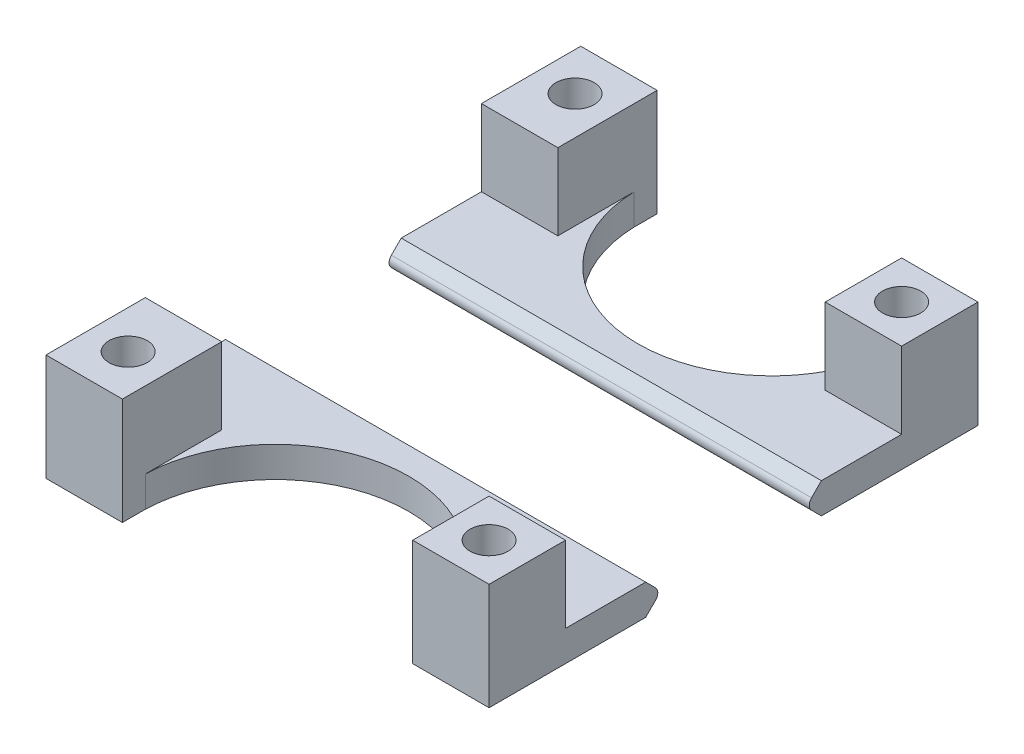
ISO-10303-21;
HEADER;
FILE_DESCRIPTION(('STEP AP214'),'2;1');
FILE_NAME('part.step','',(''),(''),'','','');
FILE_SCHEMA(('AUTOMOTIVE_DESIGN { 1 0 10303 214 1 1 1 1 }'));
ENDSEC;
DATA;
#1=APPLICATION_CONTEXT('core data for automotive mechanical design processes');
#2=APPLICATION_PROTOCOL_DEFINITION('international standard','automotive_design',2000,#1);
#3=PRODUCT_CONTEXT('',#1,'mechanical');
#4=PRODUCT('Part','Part','',(#3));
#5=PRODUCT_RELATED_PRODUCT_CATEGORY('part','',(#4));
#6=PRODUCT_DEFINITION_FORMATION('','',#4);
#7=PRODUCT_DEFINITION_CONTEXT('part definition',#1,'design');
#8=PRODUCT_DEFINITION('design','',#6,#7);
#9=PRODUCT_DEFINITION_SHAPE('','',#8);
#10=(LENGTH_UNIT() NAMED_UNIT(*) SI_UNIT(.MILLI.,.METRE.));
#11=(NAMED_UNIT(*) PLANE_ANGLE_UNIT() SI_UNIT($,.RADIAN.));
#12=(NAMED_UNIT(*) SI_UNIT($,.STERADIAN.) SOLID_ANGLE_UNIT());
#13=UNCERTAINTY_MEASURE_WITH_UNIT(LENGTH_MEASURE(1.E-05),#10,'distance_accuracy_value','');
#14=(GEOMETRIC_REPRESENTATION_CONTEXT(3) GLOBAL_UNCERTAINTY_ASSIGNED_CONTEXT((#13)) GLOBAL_UNIT_ASSIGNED_CONTEXT((#10,
#11,#12)) REPRESENTATION_CONTEXT('',''));
#15=CARTESIAN_POINT('',(0.,0.,0.));
#16=DIRECTION('',(0.,0.,1.));
#17=DIRECTION('',(1.,0.,0.));
#18=AXIS2_PLACEMENT_3D('',#15,#16,#17);
#19=CARTESIAN_POINT('',(0.,4.,0.));
#20=DIRECTION('',(0.,1.,0.));
#21=DIRECTION('',(0.,0.,1.));
#22=AXIS2_PLACEMENT_3D('',#19,#20,#21);
#23=PLANE('',#22);
#24=DIRECTION('',(1.,0.,0.));
#25=VECTOR('',#24,1.);
#26=CARTESIAN_POINT('',(-4.47213595499969,4.,11.5));
#27=LINE('',#26,#25);
#28=CARTESIAN_POINT('',(-1.07051147669731E-13,4.,11.5));
#29=VERTEX_POINT('',#28);
#30=CARTESIAN_POINT('',(55.,4.,11.5));
#31=VERTEX_POINT('',#30);
#32=EDGE_CURVE('E284',#29,#31,#27,.T.);
#33=ORIENTED_EDGE('',*,*,#32,.F.);
#34=DIRECTION('',(0.,0.,1.));
#35=VECTOR('',#34,1.);
#36=CARTESIAN_POINT('',(0.,4.,0.));
#37=LINE('',#36,#35);
#38=CARTESIAN_POINT('',(-1.30891831136949E-13,4.,22.));
#39=VERTEX_POINT('',#38);
#40=EDGE_CURVE('E299',#29,#39,#37,.T.);
#41=ORIENTED_EDGE('',*,*,#40,.T.);
#42=DIRECTION('',(-1.,0.,0.));
#43=VECTOR('',#42,1.);
#44=CARTESIAN_POINT('',(10.,4.,22.));
#45=LINE('',#44,#43);
#46=CARTESIAN_POINT('',(10.,4.,22.));
#47=VERTEX_POINT('',#46);
#48=EDGE_CURVE('E255',#47,#39,#45,.T.);
#49=ORIENTED_EDGE('',*,*,#48,.F.);
#50=DIRECTION('',(0.,0.,-1.));
#51=VECTOR('',#50,1.);
#52=CARTESIAN_POINT('',(10.,4.,35.));
#53=LINE('',#52,#51);
#54=CARTESIAN_POINT('',(10.,4.,32.));
#55=VERTEX_POINT('',#54);
#56=EDGE_CURVE('E189',#55,#47,#53,.T.);
#57=ORIENTED_EDGE('',*,*,#56,.F.);
#58=CARTESIAN_POINT('',(27.5,4.,32.5073529411765));
#59=DIRECTION('',(0.,1.,0.));
#60=DIRECTION('',(0.,0.,1.));
#61=AXIS2_PLACEMENT_3D('',#58,#59,#60);
#62=CIRCLE('',#61,17.5073529411765);
#63=CARTESIAN_POINT('',(45.,4.,32.));
#64=VERTEX_POINT('',#63);
#65=EDGE_CURVE('E207',#64,#55,#62,.T.);
#66=ORIENTED_EDGE('',*,*,#65,.F.);
#67=DIRECTION('',(0.,0.,1.));
#68=VECTOR('',#67,1.);
#69=CARTESIAN_POINT('',(45.,4.,32.));
#70=LINE('',#69,#68);
#71=CARTESIAN_POINT('',(45.,4.,22.));
#72=VERTEX_POINT('',#71);
#73=EDGE_CURVE('E226',#72,#64,#70,.T.);
#74=ORIENTED_EDGE('',*,*,#73,.F.);
#75=DIRECTION('',(-1.,0.,0.));
#76=VECTOR('',#75,1.);
#77=CARTESIAN_POINT('',(45.,4.,22.));
#78=LINE('',#77,#76);
#79=CARTESIAN_POINT('',(55.,4.,22.));
#80=VERTEX_POINT('',#79);
#81=EDGE_CURVE('E221',#80,#72,#78,.T.);
#82=ORIENTED_EDGE('',*,*,#81,.F.);
#83=DIRECTION('',(0.,0.,1.));
#84=VECTOR('',#83,1.);
#85=CARTESIAN_POINT('',(55.,4.,0.));
#86=LINE('',#85,#84);
#87=EDGE_CURVE('E203',#31,#80,#86,.T.);
#88=ORIENTED_EDGE('',*,*,#87,.F.);
#89=EDGE_LOOP('',(#33,#41,#49,#57,#66,#74,#82,#88));
#90=FACE_BOUND('',#89,.T.);
#91=ADVANCED_FACE('F51',(#90),#23,.T.);
#92=CARTESIAN_POINT('',(0.,4.,0.));
#93=DIRECTION('',(1.,0.,0.));
#94=DIRECTION('',(0.,0.,-1.));
#95=AXIS2_PLACEMENT_3D('',#92,#93,#94);
#96=PLANE('',#95);
#97=CARTESIAN_POINT('',(-1.05818132034585E-13,1.99999999999999,10.9142135623731));
#98=DIRECTION('',(1.,0.,0.));
#99=DIRECTION('',(0.,0.,-1.));
#100=AXIS2_PLACEMENT_3D('',#97,#98,#99);
#101=CIRCLE('',#100,1.);
#102=CARTESIAN_POINT('',(-1.04195021618558E-13,1.29289321881344,10.2071067811866));
#103=VERTEX_POINT('',#102);
#104=CARTESIAN_POINT('',(-1.05818132034585E-13,2.70710678118655,10.2071067811866));
#105=VERTEX_POINT('',#104);
#106=EDGE_CURVE('E155',#103,#105,#101,.T.);
#107=ORIENTED_EDGE('',*,*,#106,.F.);
#108=DIRECTION('',(0.,0.707106781186551,-0.707106781186544));
#109=VECTOR('',#108,1.);
#110=CARTESIAN_POINT('',(-1.04083408558608E-13,1.29289321881344,10.2071067811866));
#111=LINE('',#110,#109);
#112=CARTESIAN_POINT('',(-1.07051147669731E-13,0.,11.5));
#113=VERTEX_POINT('',#112);
#114=EDGE_CURVE('E292',#113,#103,#111,.T.);
#115=ORIENTED_EDGE('',*,*,#114,.F.);
#116=DIRECTION('',(0.,0.,1.));
#117=VECTOR('',#116,1.);
#118=CARTESIAN_POINT('',(0.,0.,0.));
#119=LINE('',#118,#117);
#120=CARTESIAN_POINT('',(0.,0.,35.));
#121=VERTEX_POINT('',#120);
#122=EDGE_CURVE('E54',#113,#121,#119,.T.);
#123=ORIENTED_EDGE('',*,*,#122,.T.);
#124=DIRECTION('',(0.,-1.,0.));
#125=VECTOR('',#124,1.);
#126=CARTESIAN_POINT('',(0.,4.,35.));
#127=LINE('',#126,#125);
#128=CARTESIAN_POINT('',(0.,14.,35.));
#129=VERTEX_POINT('',#128);
#130=EDGE_CURVE('E190',#129,#121,#127,.T.);
#131=ORIENTED_EDGE('',*,*,#130,.F.);
#132=DIRECTION('',(0.,0.,1.));
#133=VECTOR('',#132,1.);
#134=CARTESIAN_POINT('',(0.,14.,22.));
#135=LINE('',#134,#133);
#136=CARTESIAN_POINT('',(0.,14.,22.));
#137=VERTEX_POINT('',#136);
#138=EDGE_CURVE('E269',#137,#129,#135,.T.);
#139=ORIENTED_EDGE('',*,*,#138,.F.);
#140=DIRECTION('',(0.,-1.,0.));
#141=VECTOR('',#140,1.);
#142=CARTESIAN_POINT('',(0.,14.,22.));
#143=LINE('',#142,#141);
#144=EDGE_CURVE('E194',#137,#39,#143,.T.);
#145=ORIENTED_EDGE('',*,*,#144,.T.);
#146=ORIENTED_EDGE('',*,*,#40,.F.);
#147=DIRECTION('',(0.,0.707106781186546,0.707106781186549));
#148=VECTOR('',#147,1.);
#149=CARTESIAN_POINT('',(-1.04083408558608E-13,2.70710678118655,10.2071067811866));
#150=LINE('',#149,#148);
#151=EDGE_CURVE('E254',#105,#29,#150,.T.);
#152=ORIENTED_EDGE('',*,*,#151,.F.);
#153=EDGE_LOOP('',(#107,#115,#123,#131,#139,#145,#146,#152));
#154=FACE_BOUND('',#153,.T.);
#155=ADVANCED_FACE('F308',(#154),#96,.F.);
#156=CARTESIAN_POINT('',(0.,4.,35.));
#157=DIRECTION('',(0.,0.,-1.));
#158=DIRECTION('',(-1.,0.,0.));
#159=AXIS2_PLACEMENT_3D('',#156,#157,#158);
#160=PLANE('',#159);
#161=DIRECTION('',(1.,0.,0.));
#162=VECTOR('',#161,1.);
#163=CARTESIAN_POINT('',(0.,0.,35.));
#164=LINE('',#163,#162);
#165=CARTESIAN_POINT('',(10.,0.,35.));
#166=VERTEX_POINT('',#165);
#167=EDGE_CURVE('E191',#121,#166,#164,.T.);
#168=ORIENTED_EDGE('',*,*,#167,.T.);
#169=DIRECTION('',(0.,-1.,0.));
#170=VECTOR('',#169,1.);
#171=CARTESIAN_POINT('',(10.,4.,35.));
#172=LINE('',#171,#170);
#173=CARTESIAN_POINT('',(10.,14.,35.));
#174=VERTEX_POINT('',#173);
#175=EDGE_CURVE('E211',#174,#166,#172,.T.);
#176=ORIENTED_EDGE('',*,*,#175,.F.);
#177=DIRECTION('',(1.,0.,0.));
#178=VECTOR('',#177,1.);
#179=CARTESIAN_POINT('',(10.,14.,35.));
#180=LINE('',#179,#178);
#181=EDGE_CURVE('E262',#129,#174,#180,.T.);
#182=ORIENTED_EDGE('',*,*,#181,.F.);
#183=ORIENTED_EDGE('',*,*,#130,.T.);
#184=EDGE_LOOP('',(#168,#176,#182,#183));
#185=FACE_BOUND('',#184,.T.);
#186=ADVANCED_FACE('F312',(#185),#160,.F.);
#187=CARTESIAN_POINT('',(10.,4.,0.));
#188=DIRECTION('',(-1.,0.,0.));
#189=DIRECTION('',(0.,0.,1.));
#190=AXIS2_PLACEMENT_3D('',#187,#188,#189);
#191=PLANE('',#190);
#192=DIRECTION('',(0.,0.,-1.));
#193=VECTOR('',#192,1.);
#194=CARTESIAN_POINT('',(10.,0.,0.));
#195=LINE('',#194,#193);
#196=CARTESIAN_POINT('',(10.,0.,32.));
#197=VERTEX_POINT('',#196);
#198=EDGE_CURVE('E185',#166,#197,#195,.T.);
#199=ORIENTED_EDGE('',*,*,#198,.T.);
#200=DIRECTION('',(0.,-1.,0.));
#201=VECTOR('',#200,1.);
#202=CARTESIAN_POINT('',(10.,4.,32.));
#203=LINE('',#202,#201);
#204=EDGE_CURVE('E210',#55,#197,#203,.T.);
#205=ORIENTED_EDGE('',*,*,#204,.F.);
#206=ORIENTED_EDGE('',*,*,#56,.T.);
#207=DIRECTION('',(0.,-1.,0.));
#208=VECTOR('',#207,1.);
#209=CARTESIAN_POINT('',(10.,14.,22.));
#210=LINE('',#209,#208);
#211=CARTESIAN_POINT('',(10.,14.,22.));
#212=VERTEX_POINT('',#211);
#213=EDGE_CURVE('E250',#212,#47,#210,.T.);
#214=ORIENTED_EDGE('',*,*,#213,.F.);
#215=DIRECTION('',(0.,0.,-1.));
#216=VECTOR('',#215,1.);
#217=CARTESIAN_POINT('',(10.,14.,35.));
#218=LINE('',#217,#216);
#219=EDGE_CURVE('E220',#174,#212,#218,.T.);
#220=ORIENTED_EDGE('',*,*,#219,.F.);
#221=ORIENTED_EDGE('',*,*,#175,.T.);
#222=EDGE_LOOP('',(#199,#205,#206,#214,#220,#221));
#223=FACE_BOUND('',#222,.T.);
#224=ADVANCED_FACE('F320',(#223),#191,.F.);
#225=CARTESIAN_POINT('',(27.5,4.,32.5073529411765));
#226=DIRECTION('',(0.,-1.,0.));
#227=DIRECTION('',(0.,0.,-1.));
#228=AXIS2_PLACEMENT_3D('',#225,#226,#227);
#229=CYLINDRICAL_SURFACE('',#228,17.5073529411765);
#230=CARTESIAN_POINT('',(27.5,0.,32.5073529411765));
#231=DIRECTION('',(0.,1.,0.));
#232=DIRECTION('',(0.,0.,1.));
#233=AXIS2_PLACEMENT_3D('',#230,#231,#232);
#234=CIRCLE('',#233,17.5073529411765);
#235=CARTESIAN_POINT('',(45.,0.,32.));
#236=VERTEX_POINT('',#235);
#237=EDGE_CURVE('E176',#236,#197,#234,.T.);
#238=ORIENTED_EDGE('',*,*,#237,.F.);
#239=DIRECTION('',(0.,-1.,0.));
#240=VECTOR('',#239,1.);
#241=CARTESIAN_POINT('',(45.,4.,32.));
#242=LINE('',#241,#240);
#243=EDGE_CURVE('E206',#64,#236,#242,.T.);
#244=ORIENTED_EDGE('',*,*,#243,.F.);
#245=ORIENTED_EDGE('',*,*,#65,.T.);
#246=ORIENTED_EDGE('',*,*,#204,.T.);
#247=EDGE_LOOP('',(#238,#244,#245,#246));
#248=FACE_BOUND('',#247,.T.);
#249=ADVANCED_FACE('F334',(#248),#229,.F.);
#250=CARTESIAN_POINT('',(0.,4.,32.));
#251=DIRECTION('',(0.,0.,1.));
#252=DIRECTION('',(1.,0.,0.));
#253=AXIS2_PLACEMENT_3D('',#250,#251,#252);
#254=PLANE('',#253);
#255=DIRECTION('',(-1.,0.,0.));
#256=VECTOR('',#255,1.);
#257=CARTESIAN_POINT('',(0.,0.,32.));
#258=LINE('',#257,#256);
#259=CARTESIAN_POINT('',(55.,0.,32.));
#260=VERTEX_POINT('',#259);
#261=EDGE_CURVE('E173',#260,#236,#258,.T.);
#262=ORIENTED_EDGE('',*,*,#261,.F.);
#263=DIRECTION('',(0.,-1.,0.));
#264=VECTOR('',#263,1.);
#265=CARTESIAN_POINT('',(55.,4.,32.));
#266=LINE('',#265,#264);
#267=CARTESIAN_POINT('',(55.,14.,32.));
#268=VERTEX_POINT('',#267);
#269=EDGE_CURVE('E170',#268,#260,#266,.T.);
#270=ORIENTED_EDGE('',*,*,#269,.F.);
#271=DIRECTION('',(1.,0.,0.));
#272=VECTOR('',#271,1.);
#273=CARTESIAN_POINT('',(55.,14.,32.));
#274=LINE('',#273,#272);
#275=CARTESIAN_POINT('',(45.,14.,32.));
#276=VERTEX_POINT('',#275);
#277=EDGE_CURVE('E239',#276,#268,#274,.T.);
#278=ORIENTED_EDGE('',*,*,#277,.F.);
#279=DIRECTION('',(0.,-1.,0.));
#280=VECTOR('',#279,1.);
#281=CARTESIAN_POINT('',(45.,14.,32.));
#282=LINE('',#281,#280);
#283=EDGE_CURVE('E212',#276,#64,#282,.T.);
#284=ORIENTED_EDGE('',*,*,#283,.T.);
#285=ORIENTED_EDGE('',*,*,#243,.T.);
#286=EDGE_LOOP('',(#262,#270,#278,#284,#285));
#287=FACE_BOUND('',#286,.T.);
#288=ADVANCED_FACE('F330',(#287),#254,.T.);
#289=CARTESIAN_POINT('',(55.,4.,0.));
#290=DIRECTION('',(1.,0.,0.));
#291=DIRECTION('',(0.,0.,-1.));
#292=AXIS2_PLACEMENT_3D('',#289,#290,#291);
#293=PLANE('',#292);
#294=DIRECTION('',(0.,-0.707106781186551,0.707106781186544));
#295=VECTOR('',#294,1.);
#296=CARTESIAN_POINT('',(55.,1.29289321881344,10.2071067811866));
#297=LINE('',#296,#295);
#298=CARTESIAN_POINT('',(55.,1.29289321881344,10.2071067811866));
#299=VERTEX_POINT('',#298);
#300=CARTESIAN_POINT('',(55.,0.,11.5));
#301=VERTEX_POINT('',#300);
#302=EDGE_CURVE('E144',#299,#301,#297,.T.);
#303=ORIENTED_EDGE('',*,*,#302,.F.);
#304=CARTESIAN_POINT('',(55.,1.99999999999999,10.9142135623731));
#305=DIRECTION('',(-1.,0.,0.));
#306=DIRECTION('',(0.,0.,1.));
#307=AXIS2_PLACEMENT_3D('',#304,#305,#306);
#308=CIRCLE('',#307,1.);
#309=CARTESIAN_POINT('',(55.,2.70710678118655,10.2071067811866));
#310=VERTEX_POINT('',#309);
#311=EDGE_CURVE('E12',#310,#299,#308,.T.);
#312=ORIENTED_EDGE('',*,*,#311,.F.);
#313=DIRECTION('',(0.,-0.707106781186546,-0.707106781186549));
#314=VECTOR('',#313,1.);
#315=CARTESIAN_POINT('',(55.,2.70710678118655,10.2071067811866));
#316=LINE('',#315,#314);
#317=EDGE_CURVE('E288',#31,#310,#316,.T.);
#318=ORIENTED_EDGE('',*,*,#317,.F.);
#319=ORIENTED_EDGE('',*,*,#87,.T.);
#320=DIRECTION('',(0.,-1.,0.));
#321=VECTOR('',#320,1.);
#322=CARTESIAN_POINT('',(55.,14.,22.));
#323=LINE('',#322,#321);
#324=CARTESIAN_POINT('',(55.,14.,22.));
#325=VERTEX_POINT('',#324);
#326=EDGE_CURVE('E216',#325,#80,#323,.T.);
#327=ORIENTED_EDGE('',*,*,#326,.F.);
#328=DIRECTION('',(0.,0.,-1.));
#329=VECTOR('',#328,1.);
#330=CARTESIAN_POINT('',(55.,14.,22.));
#331=LINE('',#330,#329);
#332=EDGE_CURVE('E236',#268,#325,#331,.T.);
#333=ORIENTED_EDGE('',*,*,#332,.F.);
#334=ORIENTED_EDGE('',*,*,#269,.T.);
#335=DIRECTION('',(0.,0.,1.));
#336=VECTOR('',#335,1.);
#337=CARTESIAN_POINT('',(55.,0.,0.));
#338=LINE('',#337,#336);
#339=EDGE_CURVE('E162',#301,#260,#338,.T.);
#340=ORIENTED_EDGE('',*,*,#339,.F.);
#341=EDGE_LOOP('',(#303,#312,#318,#319,#327,#333,#334,#340));
#342=FACE_BOUND('',#341,.T.);
#343=ADVANCED_FACE('F168',(#342),#293,.T.);
#344=CARTESIAN_POINT('',(50.,4.,27.));
#345=DIRECTION('',(0.,-1.,0.));
#346=DIRECTION('',(0.,0.,-1.));
#347=AXIS2_PLACEMENT_3D('',#344,#345,#346);
#348=CYLINDRICAL_SURFACE('',#347,2.5);
#349=CARTESIAN_POINT('',(50.,0.,27.));
#350=DIRECTION('',(0.,1.,0.));
#351=DIRECTION('',(0.,0.,1.));
#352=AXIS2_PLACEMENT_3D('',#349,#350,#351);
#353=CIRCLE('',#352,2.5);
#354=CARTESIAN_POINT('',(50.,0.,29.5));
#355=VERTEX_POINT('',#354);
#356=EDGE_CURVE('E195',#355,#355,#353,.T.);
#357=ORIENTED_EDGE('',*,*,#356,.F.);
#358=EDGE_LOOP('',(#357));
#359=FACE_BOUND('',#358,.T.);
#360=CARTESIAN_POINT('',(50.,14.,27.));
#361=DIRECTION('',(0.,1.,0.));
#362=DIRECTION('',(0.,0.,1.));
#363=AXIS2_PLACEMENT_3D('',#360,#361,#362);
#364=CIRCLE('',#363,2.5);
#365=CARTESIAN_POINT('',(50.,14.,29.5));
#366=VERTEX_POINT('',#365);
#367=EDGE_CURVE('E246',#366,#366,#364,.T.);
#368=ORIENTED_EDGE('',*,*,#367,.T.);
#369=EDGE_LOOP('',(#368));
#370=FACE_BOUND('',#369,.T.);
#371=ADVANCED_FACE('F376',(#359,#370),#348,.F.);
#372=CARTESIAN_POINT('',(5.,4.,29.25));
#373=DIRECTION('',(0.,-1.,0.));
#374=DIRECTION('',(0.,0.,-1.));
#375=AXIS2_PLACEMENT_3D('',#372,#373,#374);
#376=CYLINDRICAL_SURFACE('',#375,2.5);
#377=CARTESIAN_POINT('',(5.,0.,29.25));
#378=DIRECTION('',(0.,1.,0.));
#379=DIRECTION('',(0.,0.,1.));
#380=AXIS2_PLACEMENT_3D('',#377,#378,#379);
#381=CIRCLE('',#380,2.5);
#382=CARTESIAN_POINT('',(5.,0.,31.75));
#383=VERTEX_POINT('',#382);
#384=EDGE_CURVE('E184',#383,#383,#381,.T.);
#385=ORIENTED_EDGE('',*,*,#384,.F.);
#386=EDGE_LOOP('',(#385));
#387=FACE_BOUND('',#386,.T.);
#388=CARTESIAN_POINT('',(5.,14.,29.25));
#389=DIRECTION('',(0.,1.,0.));
#390=DIRECTION('',(0.,0.,1.));
#391=AXIS2_PLACEMENT_3D('',#388,#389,#390);
#392=CIRCLE('',#391,2.5);
#393=CARTESIAN_POINT('',(5.,14.,31.75));
#394=VERTEX_POINT('',#393);
#395=EDGE_CURVE('E166',#394,#394,#392,.T.);
#396=ORIENTED_EDGE('',*,*,#395,.T.);
#397=EDGE_LOOP('',(#396));
#398=FACE_BOUND('',#397,.T.);
#399=ADVANCED_FACE('F368',(#387,#398),#376,.F.);
#400=CARTESIAN_POINT('',(0.,0.,0.));
#401=DIRECTION('',(0.,1.,0.));
#402=DIRECTION('',(0.,0.,1.));
#403=AXIS2_PLACEMENT_3D('',#400,#401,#402);
#404=PLANE('',#403);
#405=ORIENTED_EDGE('',*,*,#122,.F.);
#406=DIRECTION('',(1.,0.,0.));
#407=VECTOR('',#406,1.);
#408=CARTESIAN_POINT('',(-4.47213595499969,0.,11.5));
#409=LINE('',#408,#407);
#410=EDGE_CURVE('E147',#113,#301,#409,.T.);
#411=ORIENTED_EDGE('',*,*,#410,.T.);
#412=ORIENTED_EDGE('',*,*,#339,.T.);
#413=ORIENTED_EDGE('',*,*,#261,.T.);
#414=ORIENTED_EDGE('',*,*,#237,.T.);
#415=ORIENTED_EDGE('',*,*,#198,.F.);
#416=ORIENTED_EDGE('',*,*,#167,.F.);
#417=EDGE_LOOP('',(#405,#411,#412,#413,#414,#415,#416));
#418=FACE_BOUND('',#417,.T.);
#419=ORIENTED_EDGE('',*,*,#384,.T.);
#420=EDGE_LOOP('',(#419));
#421=FACE_BOUND('',#420,.T.);
#422=ORIENTED_EDGE('',*,*,#356,.T.);
#423=EDGE_LOOP('',(#422));
#424=FACE_BOUND('',#423,.T.);
#425=ADVANCED_FACE('F159',(#418,#421,#424),#404,.F.);
#426=CARTESIAN_POINT('',(0.,14.,0.));
#427=DIRECTION('',(0.,-1.,0.));
#428=DIRECTION('',(0.,0.,-1.));
#429=AXIS2_PLACEMENT_3D('',#426,#427,#428);
#430=PLANE('',#429);
#431=DIRECTION('',(0.,0.,1.));
#432=VECTOR('',#431,1.);
#433=CARTESIAN_POINT('',(45.,14.,32.));
#434=LINE('',#433,#432);
#435=CARTESIAN_POINT('',(45.,14.,22.));
#436=VERTEX_POINT('',#435);
#437=EDGE_CURVE('E199',#436,#276,#434,.T.);
#438=ORIENTED_EDGE('',*,*,#437,.T.);
#439=ORIENTED_EDGE('',*,*,#277,.T.);
#440=ORIENTED_EDGE('',*,*,#332,.T.);
#441=DIRECTION('',(-1.,0.,0.));
#442=VECTOR('',#441,1.);
#443=CARTESIAN_POINT('',(45.,14.,22.));
#444=LINE('',#443,#442);
#445=EDGE_CURVE('E233',#325,#436,#444,.T.);
#446=ORIENTED_EDGE('',*,*,#445,.T.);
#447=EDGE_LOOP('',(#438,#439,#440,#446));
#448=FACE_BOUND('',#447,.T.);
#449=ORIENTED_EDGE('',*,*,#367,.F.);
#450=EDGE_LOOP('',(#449));
#451=FACE_BOUND('',#450,.T.);
#452=ADVANCED_FACE('F367',(#448,#451),#430,.F.);
#453=CARTESIAN_POINT('',(45.,14.,32.));
#454=DIRECTION('',(1.,0.,0.));
#455=DIRECTION('',(0.,0.,-1.));
#456=AXIS2_PLACEMENT_3D('',#453,#454,#455);
#457=PLANE('',#456);
#458=ORIENTED_EDGE('',*,*,#73,.T.);
#459=ORIENTED_EDGE('',*,*,#283,.F.);
#460=ORIENTED_EDGE('',*,*,#437,.F.);
#461=DIRECTION('',(0.,-1.,0.));
#462=VECTOR('',#461,1.);
#463=CARTESIAN_POINT('',(45.,14.,22.));
#464=LINE('',#463,#462);
#465=EDGE_CURVE('E222',#436,#72,#464,.T.);
#466=ORIENTED_EDGE('',*,*,#465,.T.);
#467=EDGE_LOOP('',(#458,#459,#460,#466));
#468=FACE_BOUND('',#467,.T.);
#469=ADVANCED_FACE('F373',(#468),#457,.F.);
#470=CARTESIAN_POINT('',(45.,14.,22.));
#471=DIRECTION('',(0.,0.,1.));
#472=DIRECTION('',(1.,0.,0.));
#473=AXIS2_PLACEMENT_3D('',#470,#471,#472);
#474=PLANE('',#473);
#475=ORIENTED_EDGE('',*,*,#81,.T.);
#476=ORIENTED_EDGE('',*,*,#465,.F.);
#477=ORIENTED_EDGE('',*,*,#445,.F.);
#478=ORIENTED_EDGE('',*,*,#326,.T.);
#479=EDGE_LOOP('',(#475,#476,#477,#478));
#480=FACE_BOUND('',#479,.T.);
#481=ADVANCED_FACE('F397',(#480),#474,.F.);
#482=CARTESIAN_POINT('',(0.,14.,0.));
#483=DIRECTION('',(0.,1.,0.));
#484=DIRECTION('',(0.,0.,1.));
#485=AXIS2_PLACEMENT_3D('',#482,#483,#484);
#486=PLANE('',#485);
#487=ORIENTED_EDGE('',*,*,#219,.T.);
#488=DIRECTION('',(-1.,0.,0.));
#489=VECTOR('',#488,1.);
#490=CARTESIAN_POINT('',(10.,14.,22.));
#491=LINE('',#490,#489);
#492=EDGE_CURVE('E273',#212,#137,#491,.T.);
#493=ORIENTED_EDGE('',*,*,#492,.T.);
#494=ORIENTED_EDGE('',*,*,#138,.T.);
#495=ORIENTED_EDGE('',*,*,#181,.T.);
#496=EDGE_LOOP('',(#487,#493,#494,#495));
#497=FACE_BOUND('',#496,.T.);
#498=ORIENTED_EDGE('',*,*,#395,.F.);
#499=EDGE_LOOP('',(#498));
#500=FACE_BOUND('',#499,.T.);
#501=ADVANCED_FACE('F340',(#497,#500),#486,.T.);
#502=CARTESIAN_POINT('',(10.,14.,22.));
#503=DIRECTION('',(0.,0.,1.));
#504=DIRECTION('',(1.,0.,0.));
#505=AXIS2_PLACEMENT_3D('',#502,#503,#504);
#506=PLANE('',#505);
#507=ORIENTED_EDGE('',*,*,#48,.T.);
#508=ORIENTED_EDGE('',*,*,#144,.F.);
#509=ORIENTED_EDGE('',*,*,#492,.F.);
#510=ORIENTED_EDGE('',*,*,#213,.T.);
#511=EDGE_LOOP('',(#507,#508,#509,#510));
#512=FACE_BOUND('',#511,.T.);
#513=ADVANCED_FACE('F337',(#512),#506,.F.);
#514=CARTESIAN_POINT('',(-4.47213595499969,2.70710678118655,10.2071067811866));
#515=DIRECTION('',(0.,-0.707106781186549,0.707106781186546));
#516=DIRECTION('',(0.,-0.707106781186546,-0.707106781186549));
#517=AXIS2_PLACEMENT_3D('',#514,#515,#516);
#518=PLANE('',#517);
#519=ORIENTED_EDGE('',*,*,#151,.T.);
#520=ORIENTED_EDGE('',*,*,#32,.T.);
#521=ORIENTED_EDGE('',*,*,#317,.T.);
#522=DIRECTION('',(1.,0.,0.));
#523=VECTOR('',#522,1.);
#524=CARTESIAN_POINT('',(-4.47213595499969,2.70710678118655,10.2071067811866));
#525=LINE('',#524,#523);
#526=EDGE_CURVE('E61',#105,#310,#525,.T.);
#527=ORIENTED_EDGE('',*,*,#526,.F.);
#528=EDGE_LOOP('',(#519,#520,#521,#527));
#529=FACE_BOUND('',#528,.T.);
#530=ADVANCED_FACE('F344',(#529),#518,.F.);
#531=CARTESIAN_POINT('',(-4.47213595499969,1.29289321881344,10.2071067811866));
#532=DIRECTION('',(0.,0.707106781186544,0.707106781186551));
#533=DIRECTION('',(0.,-0.707106781186551,0.707106781186544));
#534=AXIS2_PLACEMENT_3D('',#531,#532,#533);
#535=PLANE('',#534);
#536=ORIENTED_EDGE('',*,*,#114,.T.);
#537=DIRECTION('',(1.,0.,0.));
#538=VECTOR('',#537,1.);
#539=CARTESIAN_POINT('',(-4.47213595499969,1.29289321881344,10.2071067811866));
#540=LINE('',#539,#538);
#541=EDGE_CURVE('E150',#103,#299,#540,.T.);
#542=ORIENTED_EDGE('',*,*,#541,.T.);
#543=ORIENTED_EDGE('',*,*,#302,.T.);
#544=ORIENTED_EDGE('',*,*,#410,.F.);
#545=EDGE_LOOP('',(#536,#542,#543,#544));
#546=FACE_BOUND('',#545,.T.);
#547=ADVANCED_FACE('F146',(#546),#535,.F.);
#548=CARTESIAN_POINT('',(-4.47213595499969,1.99999999999999,10.9142135623731));
#549=DIRECTION('',(1.,0.,0.));
#550=DIRECTION('',(0.,0.,-1.));
#551=AXIS2_PLACEMENT_3D('',#548,#549,#550);
#552=CYLINDRICAL_SURFACE('',#551,1.);
#553=ORIENTED_EDGE('',*,*,#106,.T.);
#554=ORIENTED_EDGE('',*,*,#526,.T.);
#555=ORIENTED_EDGE('',*,*,#311,.T.);
#556=ORIENTED_EDGE('',*,*,#541,.F.);
#557=EDGE_LOOP('',(#553,#554,#555,#556));
#558=FACE_BOUND('',#557,.T.);
#559=ADVANCED_FACE('F349',(#558),#552,.T.);
#560=CLOSED_SHELL('',(#91,#155,#186,#224,#249,#288,#343,#371,#399,#425,#452,#469,#481,#501,#513,
#530,#547,#559));
#561=MANIFOLD_SOLID_BREP('B2',#560);
#562=CARTESIAN_POINT('',(45.,14.,-32.));
#563=DIRECTION('',(1.,0.,0.));
#564=DIRECTION('',(0.,0.,-1.));
#565=AXIS2_PLACEMENT_3D('',#562,#563,#564);
#566=PLANE('',#565);
#567=DIRECTION('',(0.,0.,1.));
#568=VECTOR('',#567,1.);
#569=CARTESIAN_POINT('',(45.,4.,-32.));
#570=LINE('',#569,#568);
#571=CARTESIAN_POINT('',(45.,4.,-32.));
#572=VERTEX_POINT('',#571);
#573=CARTESIAN_POINT('',(45.,4.,-22.));
#574=VERTEX_POINT('',#573);
#575=EDGE_CURVE('E792',#572,#574,#570,.T.);
#576=ORIENTED_EDGE('',*,*,#575,.T.);
#577=DIRECTION('',(0.,-1.,0.));
#578=VECTOR('',#577,1.);
#579=CARTESIAN_POINT('',(45.,14.,-22.));
#580=LINE('',#579,#578);
#581=CARTESIAN_POINT('',(45.,14.,-22.));
#582=VERTEX_POINT('',#581);
#583=EDGE_CURVE('E788',#582,#574,#580,.T.);
#584=ORIENTED_EDGE('',*,*,#583,.F.);
#585=DIRECTION('',(0.,0.,1.));
#586=VECTOR('',#585,1.);
#587=CARTESIAN_POINT('',(45.,14.,-32.));
#588=LINE('',#587,#586);
#589=CARTESIAN_POINT('',(45.,14.,-32.));
#590=VERTEX_POINT('',#589);
#591=EDGE_CURVE('E791',#590,#582,#588,.T.);
#592=ORIENTED_EDGE('',*,*,#591,.F.);
#593=DIRECTION('',(0.,-1.,0.));
#594=VECTOR('',#593,1.);
#595=CARTESIAN_POINT('',(45.,14.,-32.));
#596=LINE('',#595,#594);
#597=EDGE_CURVE('E785',#590,#572,#596,.T.);
#598=ORIENTED_EDGE('',*,*,#597,.T.);
#599=EDGE_LOOP('',(#576,#584,#592,#598));
#600=FACE_BOUND('',#599,.T.);
#601=ADVANCED_FACE('F594',(#600),#566,.F.);
#602=CARTESIAN_POINT('',(0.,14.,0.));
#603=DIRECTION('',(0.,1.,0.));
#604=DIRECTION('',(0.,0.,1.));
#605=AXIS2_PLACEMENT_3D('',#602,#603,#604);
#606=PLANE('',#605);
#607=DIRECTION('',(1.,0.,0.));
#608=VECTOR('',#607,1.);
#609=CARTESIAN_POINT('',(0.,14.,-22.));
#610=LINE('',#609,#608);
#611=CARTESIAN_POINT('',(0.,14.,-22.));
#612=VERTEX_POINT('',#611);
#613=CARTESIAN_POINT('',(10.,14.,-22.));
#614=VERTEX_POINT('',#613);
#615=EDGE_CURVE('E766',#612,#614,#610,.T.);
#616=ORIENTED_EDGE('',*,*,#615,.T.);
#617=DIRECTION('',(0.,0.,-1.));
#618=VECTOR('',#617,1.);
#619=CARTESIAN_POINT('',(10.,14.,-22.));
#620=LINE('',#619,#618);
#621=CARTESIAN_POINT('',(10.,14.,-35.));
#622=VERTEX_POINT('',#621);
#623=EDGE_CURVE('E775',#614,#622,#620,.T.);
#624=ORIENTED_EDGE('',*,*,#623,.T.);
#625=DIRECTION('',(-1.,0.,0.));
#626=VECTOR('',#625,1.);
#627=CARTESIAN_POINT('',(10.,14.,-35.));
#628=LINE('',#627,#626);
#629=CARTESIAN_POINT('',(0.,14.,-35.));
#630=VERTEX_POINT('',#629);
#631=EDGE_CURVE('E772',#622,#630,#628,.T.);
#632=ORIENTED_EDGE('',*,*,#631,.T.);
#633=DIRECTION('',(0.,0.,1.));
#634=VECTOR('',#633,1.);
#635=CARTESIAN_POINT('',(0.,14.,-35.));
#636=LINE('',#635,#634);
#637=EDGE_CURVE('E764',#630,#612,#636,.T.);
#638=ORIENTED_EDGE('',*,*,#637,.T.);
#639=EDGE_LOOP('',(#616,#624,#632,#638));
#640=FACE_BOUND('',#639,.T.);
#641=CARTESIAN_POINT('',(5.,14.,-29.25));
#642=DIRECTION('',(0.,1.,0.));
#643=DIRECTION('',(0.,0.,1.));
#644=AXIS2_PLACEMENT_3D('',#641,#642,#643);
#645=CIRCLE('',#644,2.5);
#646=CARTESIAN_POINT('',(5.,14.,-26.75));
#647=VERTEX_POINT('',#646);
#648=EDGE_CURVE('E770',#647,#647,#645,.T.);
#649=ORIENTED_EDGE('',*,*,#648,.F.);
#650=EDGE_LOOP('',(#649));
#651=FACE_BOUND('',#650,.T.);
#652=ADVANCED_FACE('F832',(#640,#651),#606,.T.);
#653=CARTESIAN_POINT('',(0.,14.,-22.));
#654=DIRECTION('',(0.,0.,-1.));
#655=DIRECTION('',(-1.,0.,0.));
#656=AXIS2_PLACEMENT_3D('',#653,#654,#655);
#657=PLANE('',#656);
#658=DIRECTION('',(1.,0.,0.));
#659=VECTOR('',#658,1.);
#660=CARTESIAN_POINT('',(0.,4.,-22.));
#661=LINE('',#660,#659);
#662=CARTESIAN_POINT('',(0.,4.,-22.));
#663=VERTEX_POINT('',#662);
#664=CARTESIAN_POINT('',(10.,4.,-22.));
#665=VERTEX_POINT('',#664);
#666=EDGE_CURVE('E767',#663,#665,#661,.T.);
#667=ORIENTED_EDGE('',*,*,#666,.T.);
#668=DIRECTION('',(0.,-1.,0.));
#669=VECTOR('',#668,1.);
#670=CARTESIAN_POINT('',(10.,14.,-22.));
#671=LINE('',#670,#669);
#672=EDGE_CURVE('E756',#614,#665,#671,.T.);
#673=ORIENTED_EDGE('',*,*,#672,.F.);
#674=ORIENTED_EDGE('',*,*,#615,.F.);
#675=DIRECTION('',(0.,-1.,0.));
#676=VECTOR('',#675,1.);
#677=CARTESIAN_POINT('',(0.,14.,-22.));
#678=LINE('',#677,#676);
#679=EDGE_CURVE('E761',#612,#663,#678,.T.);
#680=ORIENTED_EDGE('',*,*,#679,.T.);
#681=EDGE_LOOP('',(#667,#673,#674,#680));
#682=FACE_BOUND('',#681,.T.);
#683=ADVANCED_FACE('F838',(#682),#657,.F.);
#684=CARTESIAN_POINT('',(45.,14.,-22.));
#685=DIRECTION('',(0.,0.,-1.));
#686=DIRECTION('',(-1.,0.,0.));
#687=AXIS2_PLACEMENT_3D('',#684,#685,#686);
#688=PLANE('',#687);
#689=DIRECTION('',(1.,0.,0.));
#690=VECTOR('',#689,1.);
#691=CARTESIAN_POINT('',(45.,4.,-22.));
#692=LINE('',#691,#690);
#693=CARTESIAN_POINT('',(55.,4.,-22.));
#694=VERTEX_POINT('',#693);
#695=EDGE_CURVE('E617',#574,#694,#692,.T.);
#696=ORIENTED_EDGE('',*,*,#695,.T.);
#697=DIRECTION('',(0.,-1.,0.));
#698=VECTOR('',#697,1.);
#699=CARTESIAN_POINT('',(55.,14.,-22.));
#700=LINE('',#699,#698);
#701=CARTESIAN_POINT('',(55.,14.,-22.));
#702=VERTEX_POINT('',#701);
#703=EDGE_CURVE('E782',#702,#694,#700,.T.);
#704=ORIENTED_EDGE('',*,*,#703,.F.);
#705=DIRECTION('',(1.,0.,0.));
#706=VECTOR('',#705,1.);
#707=CARTESIAN_POINT('',(45.,14.,-22.));
#708=LINE('',#707,#706);
#709=EDGE_CURVE('E794',#582,#702,#708,.T.);
#710=ORIENTED_EDGE('',*,*,#709,.F.);
#711=ORIENTED_EDGE('',*,*,#583,.T.);
#712=EDGE_LOOP('',(#696,#704,#710,#711));
#713=FACE_BOUND('',#712,.T.);
#714=ADVANCED_FACE('F855',(#713),#688,.F.);
#715=CARTESIAN_POINT('',(0.,14.,0.));
#716=DIRECTION('',(0.,1.,0.));
#717=DIRECTION('',(0.,0.,1.));
#718=AXIS2_PLACEMENT_3D('',#715,#716,#717);
#719=PLANE('',#718);
#720=ORIENTED_EDGE('',*,*,#709,.T.);
#721=DIRECTION('',(0.,0.,-1.));
#722=VECTOR('',#721,1.);
#723=CARTESIAN_POINT('',(55.,14.,-22.));
#724=LINE('',#723,#722);
#725=CARTESIAN_POINT('',(55.,14.,-32.));
#726=VERTEX_POINT('',#725);
#727=EDGE_CURVE('E800',#702,#726,#724,.T.);
#728=ORIENTED_EDGE('',*,*,#727,.T.);
#729=DIRECTION('',(-1.,0.,0.));
#730=VECTOR('',#729,1.);
#731=CARTESIAN_POINT('',(55.,14.,-32.));
#732=LINE('',#731,#730);
#733=EDGE_CURVE('E798',#726,#590,#732,.T.);
#734=ORIENTED_EDGE('',*,*,#733,.T.);
#735=ORIENTED_EDGE('',*,*,#591,.T.);
#736=EDGE_LOOP('',(#720,#728,#734,#735));
#737=FACE_BOUND('',#736,.T.);
#738=CARTESIAN_POINT('',(50.,14.,-27.));
#739=DIRECTION('',(0.,1.,0.));
#740=DIRECTION('',(0.,0.,1.));
#741=AXIS2_PLACEMENT_3D('',#738,#739,#740);
#742=CIRCLE('',#741,2.5);
#743=CARTESIAN_POINT('',(50.,14.,-24.5));
#744=VERTEX_POINT('',#743);
#745=EDGE_CURVE('E796',#744,#744,#742,.T.);
#746=ORIENTED_EDGE('',*,*,#745,.F.);
#747=EDGE_LOOP('',(#746));
#748=FACE_BOUND('',#747,.T.);
#749=ADVANCED_FACE('F851',(#737,#748),#719,.T.);
#750=CARTESIAN_POINT('',(0.,4.,-32.));
#751=DIRECTION('',(0.,0.,1.));
#752=DIRECTION('',(1.,0.,0.));
#753=AXIS2_PLACEMENT_3D('',#750,#751,#752);
#754=PLANE('',#753);
#755=DIRECTION('',(-1.,0.,0.));
#756=VECTOR('',#755,1.);
#757=CARTESIAN_POINT('',(0.,0.,-32.));
#758=LINE('',#757,#756);
#759=CARTESIAN_POINT('',(55.,0.,-32.));
#760=VERTEX_POINT('',#759);
#761=CARTESIAN_POINT('',(45.,0.,-32.));
#762=VERTEX_POINT('',#761);
#763=EDGE_CURVE('E715',#760,#762,#758,.T.);
#764=ORIENTED_EDGE('',*,*,#763,.T.);
#765=DIRECTION('',(0.,-1.,0.));
#766=VECTOR('',#765,1.);
#767=CARTESIAN_POINT('',(45.,4.,-32.));
#768=LINE('',#767,#766);
#769=EDGE_CURVE('E49',#572,#762,#768,.T.);
#770=ORIENTED_EDGE('',*,*,#769,.F.);
#771=ORIENTED_EDGE('',*,*,#597,.F.);
#772=ORIENTED_EDGE('',*,*,#733,.F.);
#773=DIRECTION('',(0.,-1.,0.));
#774=VECTOR('',#773,1.);
#775=CARTESIAN_POINT('',(55.,4.,-32.));
#776=LINE('',#775,#774);
#777=EDGE_CURVE('E725',#726,#760,#776,.T.);
#778=ORIENTED_EDGE('',*,*,#777,.T.);
#779=EDGE_LOOP('',(#764,#770,#771,#772,#778));
#780=FACE_BOUND('',#779,.T.);
#781=ADVANCED_FACE('F844',(#780),#754,.F.);
#782=CARTESIAN_POINT('',(27.5,4.,-32.5073529411765));
#783=DIRECTION('',(0.,-1.,0.));
#784=DIRECTION('',(0.,0.,-1.));
#785=AXIS2_PLACEMENT_3D('',#782,#783,#784);
#786=CYLINDRICAL_SURFACE('',#785,17.5073529411765);
#787=CARTESIAN_POINT('',(27.5,0.,-32.5073529411765));
#788=DIRECTION('',(0.,1.,0.));
#789=DIRECTION('',(0.,0.,1.));
#790=AXIS2_PLACEMENT_3D('',#787,#788,#789);
#791=CIRCLE('',#790,17.5073529411765);
#792=CARTESIAN_POINT('',(10.,0.,-32.));
#793=VERTEX_POINT('',#792);
#794=EDGE_CURVE('E745',#762,#793,#791,.F.);
#795=ORIENTED_EDGE('',*,*,#794,.T.);
#796=DIRECTION('',(0.,-1.,0.));
#797=VECTOR('',#796,1.);
#798=CARTESIAN_POINT('',(10.,4.,-32.));
#799=LINE('',#798,#797);
#800=CARTESIAN_POINT('',(10.,4.,-32.));
#801=VERTEX_POINT('',#800);
#802=EDGE_CURVE('E602',#801,#793,#799,.T.);
#803=ORIENTED_EDGE('',*,*,#802,.F.);
#804=CARTESIAN_POINT('',(27.5,4.,-32.5073529411765));
#805=DIRECTION('',(0.,1.,0.));
#806=DIRECTION('',(0.,0.,1.));
#807=AXIS2_PLACEMENT_3D('',#804,#805,#806);
#808=CIRCLE('',#807,17.5073529411765);
#809=EDGE_CURVE('E716',#572,#801,#808,.F.);
#810=ORIENTED_EDGE('',*,*,#809,.F.);
#811=ORIENTED_EDGE('',*,*,#769,.T.);
#812=EDGE_LOOP('',(#795,#803,#810,#811));
#813=FACE_BOUND('',#812,.T.);
#814=ADVANCED_FACE('F841',(#813),#786,.F.);
#815=CARTESIAN_POINT('',(9.99999999999997,4.,0.));
#816=DIRECTION('',(-1.,0.,0.));
#817=DIRECTION('',(0.,0.,1.));
#818=AXIS2_PLACEMENT_3D('',#815,#816,#817);
#819=PLANE('',#818);
#820=DIRECTION('',(0.,0.,-1.));
#821=VECTOR('',#820,1.);
#822=CARTESIAN_POINT('',(9.99999999999997,0.,0.));
#823=LINE('',#822,#821);
#824=CARTESIAN_POINT('',(10.,0.,-35.));
#825=VERTEX_POINT('',#824);
#826=EDGE_CURVE('E739',#793,#825,#823,.T.);
#827=ORIENTED_EDGE('',*,*,#826,.T.);
#828=DIRECTION('',(0.,-1.,0.));
#829=VECTOR('',#828,1.);
#830=CARTESIAN_POINT('',(10.,4.,-35.));
#831=LINE('',#830,#829);
#832=EDGE_CURVE('E731',#622,#825,#831,.T.);
#833=ORIENTED_EDGE('',*,*,#832,.F.);
#834=ORIENTED_EDGE('',*,*,#623,.F.);
#835=ORIENTED_EDGE('',*,*,#672,.T.);
#836=DIRECTION('',(0.,0.,-1.));
#837=VECTOR('',#836,1.);
#838=CARTESIAN_POINT('',(10.,4.,-22.));
#839=LINE('',#838,#837);
#840=EDGE_CURVE('E741',#665,#801,#839,.T.);
#841=ORIENTED_EDGE('',*,*,#840,.T.);
#842=ORIENTED_EDGE('',*,*,#802,.T.);
#843=EDGE_LOOP('',(#827,#833,#834,#835,#841,#842));
#844=FACE_BOUND('',#843,.T.);
#845=ADVANCED_FACE('F738',(#844),#819,.F.);
#846=CARTESIAN_POINT('',(0.,4.,-35.));
#847=DIRECTION('',(0.,0.,1.));
#848=DIRECTION('',(1.,0.,0.));
#849=AXIS2_PLACEMENT_3D('',#846,#847,#848);
#850=PLANE('',#849);
#851=DIRECTION('',(-1.,0.,0.));
#852=VECTOR('',#851,1.);
#853=CARTESIAN_POINT('',(0.,0.,-35.));
#854=LINE('',#853,#852);
#855=CARTESIAN_POINT('',(0.,0.,-35.));
#856=VERTEX_POINT('',#855);
#857=EDGE_CURVE('E721',#825,#856,#854,.T.);
#858=ORIENTED_EDGE('',*,*,#857,.T.);
#859=DIRECTION('',(0.,-1.,0.));
#860=VECTOR('',#859,1.);
#861=CARTESIAN_POINT('',(0.,4.,-35.));
#862=LINE('',#861,#860);
#863=EDGE_CURVE('E727',#630,#856,#862,.T.);
#864=ORIENTED_EDGE('',*,*,#863,.F.);
#865=ORIENTED_EDGE('',*,*,#631,.F.);
#866=ORIENTED_EDGE('',*,*,#832,.T.);
#867=EDGE_LOOP('',(#858,#864,#865,#866));
#868=FACE_BOUND('',#867,.T.);
#869=ADVANCED_FACE('F830',(#868),#850,.F.);
#870=CARTESIAN_POINT('',(5.,4.,-29.25));
#871=DIRECTION('',(0.,-1.,0.));
#872=DIRECTION('',(0.,0.,-1.));
#873=AXIS2_PLACEMENT_3D('',#870,#871,#872);
#874=CYLINDRICAL_SURFACE('',#873,2.5);
#875=CARTESIAN_POINT('',(5.,0.,-29.25));
#876=DIRECTION('',(0.,1.,0.));
#877=DIRECTION('',(0.,0.,1.));
#878=AXIS2_PLACEMENT_3D('',#875,#876,#877);
#879=CIRCLE('',#878,2.5);
#880=CARTESIAN_POINT('',(5.,0.,-26.75));
#881=VERTEX_POINT('',#880);
#882=EDGE_CURVE('E753',#881,#881,#879,.T.);
#883=ORIENTED_EDGE('',*,*,#882,.F.);
#884=EDGE_LOOP('',(#883));
#885=FACE_BOUND('',#884,.T.);
#886=ORIENTED_EDGE('',*,*,#648,.T.);
#887=EDGE_LOOP('',(#886));
#888=FACE_BOUND('',#887,.T.);
#889=ADVANCED_FACE('F596',(#885,#888),#874,.F.);
#890=CARTESIAN_POINT('',(50.,4.,-27.));
#891=DIRECTION('',(0.,-1.,0.));
#892=DIRECTION('',(0.,0.,-1.));
#893=AXIS2_PLACEMENT_3D('',#890,#891,#892);
#894=CYLINDRICAL_SURFACE('',#893,2.5);
#895=CARTESIAN_POINT('',(50.,0.,-27.));
#896=DIRECTION('',(0.,1.,0.));
#897=DIRECTION('',(0.,0.,1.));
#898=AXIS2_PLACEMENT_3D('',#895,#896,#897);
#899=CIRCLE('',#898,2.5);
#900=CARTESIAN_POINT('',(50.,0.,-24.5));
#901=VERTEX_POINT('',#900);
#902=EDGE_CURVE('E750',#901,#901,#899,.T.);
#903=ORIENTED_EDGE('',*,*,#902,.F.);
#904=EDGE_LOOP('',(#903));
#905=FACE_BOUND('',#904,.T.);
#906=ORIENTED_EDGE('',*,*,#745,.T.);
#907=EDGE_LOOP('',(#906));
#908=FACE_BOUND('',#907,.T.);
#909=ADVANCED_FACE('F889',(#905,#908),#894,.F.);
#910=CARTESIAN_POINT('',(0.,0.,0.));
#911=DIRECTION('',(0.,1.,0.));
#912=DIRECTION('',(0.,0.,1.));
#913=AXIS2_PLACEMENT_3D('',#910,#911,#912);
#914=PLANE('',#913);
#915=ORIENTED_EDGE('',*,*,#902,.T.);
#916=EDGE_LOOP('',(#915));
#917=FACE_BOUND('',#916,.T.);
#918=ORIENTED_EDGE('',*,*,#882,.T.);
#919=EDGE_LOOP('',(#918));
#920=FACE_BOUND('',#919,.T.);
#921=DIRECTION('',(0.,0.,-1.));
#922=VECTOR('',#921,1.);
#923=CARTESIAN_POINT('',(55.,0.,0.));
#924=LINE('',#923,#922);
#925=CARTESIAN_POINT('',(55.,0.,-11.5));
#926=VERTEX_POINT('',#925);
#927=EDGE_CURVE('E706',#926,#760,#924,.T.);
#928=ORIENTED_EDGE('',*,*,#927,.F.);
#929=DIRECTION('',(1.,0.,0.));
#930=VECTOR('',#929,1.);
#931=CARTESIAN_POINT('',(-4.47213595499969,0.,-11.5));
#932=LINE('',#931,#930);
#933=CARTESIAN_POINT('',(0.,0.,-11.5));
#934=VERTEX_POINT('',#933);
#935=EDGE_CURVE('E691',#934,#926,#932,.T.);
#936=ORIENTED_EDGE('',*,*,#935,.F.);
#937=DIRECTION('',(0.,0.,1.));
#938=VECTOR('',#937,1.);
#939=CARTESIAN_POINT('',(0.,0.,0.));
#940=LINE('',#939,#938);
#941=EDGE_CURVE('E717',#856,#934,#940,.T.);
#942=ORIENTED_EDGE('',*,*,#941,.F.);
#943=ORIENTED_EDGE('',*,*,#857,.F.);
#944=ORIENTED_EDGE('',*,*,#826,.F.);
#945=ORIENTED_EDGE('',*,*,#794,.F.);
#946=ORIENTED_EDGE('',*,*,#763,.F.);
#947=EDGE_LOOP('',(#928,#936,#942,#943,#944,#945,#946));
#948=FACE_BOUND('',#947,.T.);
#949=ADVANCED_FACE('F713',(#917,#920,#948),#914,.F.);
#950=CARTESIAN_POINT('',(55.,4.,0.));
#951=DIRECTION('',(-1.,0.,0.));
#952=DIRECTION('',(0.,0.,1.));
#953=AXIS2_PLACEMENT_3D('',#950,#951,#952);
#954=PLANE('',#953);
#955=DIRECTION('',(0.,0.,-1.));
#956=VECTOR('',#955,1.);
#957=CARTESIAN_POINT('',(55.,4.,0.));
#958=LINE('',#957,#956);
#959=CARTESIAN_POINT('',(55.,4.,-11.5));
#960=VERTEX_POINT('',#959);
#961=EDGE_CURVE('E728',#960,#694,#958,.T.);
#962=ORIENTED_EDGE('',*,*,#961,.F.);
#963=DIRECTION('',(0.,0.707106781186543,-0.707106781186552));
#964=VECTOR('',#963,1.);
#965=CARTESIAN_POINT('',(55.,2.70710678118654,-10.2071067811865));
#966=LINE('',#965,#964);
#967=CARTESIAN_POINT('',(55.,2.70710678118654,-10.2071067811865));
#968=VERTEX_POINT('',#967);
#969=EDGE_CURVE('E701',#968,#960,#966,.T.);
#970=ORIENTED_EDGE('',*,*,#969,.F.);
#971=CARTESIAN_POINT('',(55.,2.,-10.9142135623731));
#972=DIRECTION('',(-1.,0.,0.));
#973=DIRECTION('',(0.,0.,-1.));
#974=AXIS2_PLACEMENT_3D('',#971,#972,#973);
#975=CIRCLE('',#974,1.);
#976=CARTESIAN_POINT('',(55.,1.29289321881345,-10.2071067811865));
#977=VERTEX_POINT('',#976);
#978=EDGE_CURVE('E710',#977,#968,#975,.T.);
#979=ORIENTED_EDGE('',*,*,#978,.F.);
#980=DIRECTION('',(0.,0.707106781186539,0.707106781186556));
#981=VECTOR('',#980,1.);
#982=CARTESIAN_POINT('',(55.,1.29289321881345,-10.2071067811865));
#983=LINE('',#982,#981);
#984=EDGE_CURVE('E694',#926,#977,#983,.T.);
#985=ORIENTED_EDGE('',*,*,#984,.F.);
#986=ORIENTED_EDGE('',*,*,#927,.T.);
#987=ORIENTED_EDGE('',*,*,#777,.F.);
#988=ORIENTED_EDGE('',*,*,#727,.F.);
#989=ORIENTED_EDGE('',*,*,#703,.T.);
#990=EDGE_LOOP('',(#962,#970,#979,#985,#986,#987,#988,#989));
#991=FACE_BOUND('',#990,.T.);
#992=ADVANCED_FACE('F705',(#991),#954,.F.);
#993=CARTESIAN_POINT('',(0.,4.,0.));
#994=DIRECTION('',(1.,0.,0.));
#995=DIRECTION('',(0.,0.,-1.));
#996=AXIS2_PLACEMENT_3D('',#993,#994,#995);
#997=PLANE('',#996);
#998=CARTESIAN_POINT('',(0.,2.,-10.9142135623731));
#999=DIRECTION('',(1.,0.,0.));
#1000=DIRECTION('',(0.,0.,-1.));
#1001=AXIS2_PLACEMENT_3D('',#998,#999,#1000);
#1002=CIRCLE('',#1001,1.);
#1003=CARTESIAN_POINT('',(0.,2.70710678118655,-10.2071067811865));
#1004=VERTEX_POINT('',#1003);
#1005=CARTESIAN_POINT('',(0.,1.29289321881344,-10.2071067811865));
#1006=VERTEX_POINT('',#1005);
#1007=EDGE_CURVE('E817',#1004,#1006,#1002,.T.);
#1008=ORIENTED_EDGE('',*,*,#1007,.F.);
#1009=DIRECTION('',(0.,-0.707106781186543,0.707106781186552));
#1010=VECTOR('',#1009,1.);
#1011=CARTESIAN_POINT('',(0.,2.70710678118654,-10.2071067811865));
#1012=LINE('',#1011,#1010);
#1013=CARTESIAN_POINT('',(0.,4.,-11.5));
#1014=VERTEX_POINT('',#1013);
#1015=EDGE_CURVE('E806',#1014,#1004,#1012,.T.);
#1016=ORIENTED_EDGE('',*,*,#1015,.F.);
#1017=DIRECTION('',(0.,0.,1.));
#1018=VECTOR('',#1017,1.);
#1019=CARTESIAN_POINT('',(0.,4.,0.));
#1020=LINE('',#1019,#1018);
#1021=EDGE_CURVE('E719',#663,#1014,#1020,.T.);
#1022=ORIENTED_EDGE('',*,*,#1021,.F.);
#1023=ORIENTED_EDGE('',*,*,#679,.F.);
#1024=ORIENTED_EDGE('',*,*,#637,.F.);
#1025=ORIENTED_EDGE('',*,*,#863,.T.);
#1026=ORIENTED_EDGE('',*,*,#941,.T.);
#1027=DIRECTION('',(0.,-0.707106781186539,-0.707106781186556));
#1028=VECTOR('',#1027,1.);
#1029=CARTESIAN_POINT('',(0.,1.29289321881345,-10.2071067811865));
#1030=LINE('',#1029,#1028);
#1031=EDGE_CURVE('E609',#1006,#934,#1030,.T.);
#1032=ORIENTED_EDGE('',*,*,#1031,.F.);
#1033=EDGE_LOOP('',(#1008,#1016,#1022,#1023,#1024,#1025,#1026,#1032));
#1034=FACE_BOUND('',#1033,.T.);
#1035=ADVANCED_FACE('F825',(#1034),#997,.F.);
#1036=CARTESIAN_POINT('',(0.,4.,0.));
#1037=DIRECTION('',(0.,1.,0.));
#1038=DIRECTION('',(0.,0.,1.));
#1039=AXIS2_PLACEMENT_3D('',#1036,#1037,#1038);
#1040=PLANE('',#1039);
#1041=DIRECTION('',(1.,0.,0.));
#1042=VECTOR('',#1041,1.);
#1043=CARTESIAN_POINT('',(-4.47213595499969,4.,-11.5));
#1044=LINE('',#1043,#1042);
#1045=EDGE_CURVE('E811',#1014,#960,#1044,.T.);
#1046=ORIENTED_EDGE('',*,*,#1045,.T.);
#1047=ORIENTED_EDGE('',*,*,#961,.T.);
#1048=ORIENTED_EDGE('',*,*,#695,.F.);
#1049=ORIENTED_EDGE('',*,*,#575,.F.);
#1050=ORIENTED_EDGE('',*,*,#809,.T.);
#1051=ORIENTED_EDGE('',*,*,#840,.F.);
#1052=ORIENTED_EDGE('',*,*,#666,.F.);
#1053=ORIENTED_EDGE('',*,*,#1021,.T.);
#1054=EDGE_LOOP('',(#1046,#1047,#1048,#1049,#1050,#1051,#1052,#1053));
#1055=FACE_BOUND('',#1054,.T.);
#1056=ADVANCED_FACE('F839',(#1055),#1040,.T.);
#1057=CARTESIAN_POINT('',(-4.47213595499969,2.70710678118654,-10.2071067811865));
#1058=DIRECTION('',(0.,-0.707106781186552,-0.707106781186543));
#1059=DIRECTION('',(0.,0.707106781186543,-0.707106781186552));
#1060=AXIS2_PLACEMENT_3D('',#1057,#1058,#1059);
#1061=PLANE('',#1060);
#1062=ORIENTED_EDGE('',*,*,#1015,.T.);
#1063=DIRECTION('',(1.,0.,0.));
#1064=VECTOR('',#1063,1.);
#1065=CARTESIAN_POINT('',(-4.47213595499969,2.70710678118654,-10.2071067811865));
#1066=LINE('',#1065,#1064);
#1067=EDGE_CURVE('E809',#1004,#968,#1066,.T.);
#1068=ORIENTED_EDGE('',*,*,#1067,.T.);
#1069=ORIENTED_EDGE('',*,*,#969,.T.);
#1070=ORIENTED_EDGE('',*,*,#1045,.F.);
#1071=EDGE_LOOP('',(#1062,#1068,#1069,#1070));
#1072=FACE_BOUND('',#1071,.T.);
#1073=ADVANCED_FACE('F875',(#1072),#1061,.F.);
#1074=CARTESIAN_POINT('',(-4.47213595499969,2.,-10.9142135623731));
#1075=DIRECTION('',(1.,0.,0.));
#1076=DIRECTION('',(0.,0.,-1.));
#1077=AXIS2_PLACEMENT_3D('',#1074,#1075,#1076);
#1078=CYLINDRICAL_SURFACE('',#1077,1.);
#1079=ORIENTED_EDGE('',*,*,#1007,.T.);
#1080=DIRECTION('',(1.,0.,0.));
#1081=VECTOR('',#1080,1.);
#1082=CARTESIAN_POINT('',(-4.47213595499969,1.29289321881345,-10.2071067811865));
#1083=LINE('',#1082,#1081);
#1084=EDGE_CURVE('E700',#1006,#977,#1083,.T.);
#1085=ORIENTED_EDGE('',*,*,#1084,.T.);
#1086=ORIENTED_EDGE('',*,*,#978,.T.);
#1087=ORIENTED_EDGE('',*,*,#1067,.F.);
#1088=EDGE_LOOP('',(#1079,#1085,#1086,#1087));
#1089=FACE_BOUND('',#1088,.T.);
#1090=ADVANCED_FACE('F822',(#1089),#1078,.T.);
#1091=CARTESIAN_POINT('',(-4.47213595499969,1.29289321881345,-10.2071067811865));
#1092=DIRECTION('',(0.,0.707106781186556,-0.707106781186539));
#1093=DIRECTION('',(0.,0.707106781186539,0.707106781186556));
#1094=AXIS2_PLACEMENT_3D('',#1091,#1092,#1093);
#1095=PLANE('',#1094);
#1096=ORIENTED_EDGE('',*,*,#1031,.T.);
#1097=ORIENTED_EDGE('',*,*,#935,.T.);
#1098=ORIENTED_EDGE('',*,*,#984,.T.);
#1099=ORIENTED_EDGE('',*,*,#1084,.F.);
#1100=EDGE_LOOP('',(#1096,#1097,#1098,#1099));
#1101=FACE_BOUND('',#1100,.T.);
#1102=ADVANCED_FACE('F693',(#1101),#1095,.F.);
#1103=CLOSED_SHELL('',(#601,#652,#683,#714,#749,#781,#814,#845,#869,#889,#909,#949,#992,#1035,
#1056,#1073,#1090,#1102));
#1104=MANIFOLD_SOLID_BREP('B6',#1103);
#1105=ADVANCED_BREP_SHAPE_REPRESENTATION('',(#18,#561,#1104),#14);
#1106=SHAPE_DEFINITION_REPRESENTATION(#9,#1105);
ENDSEC;
END-ISO-10303-21;
